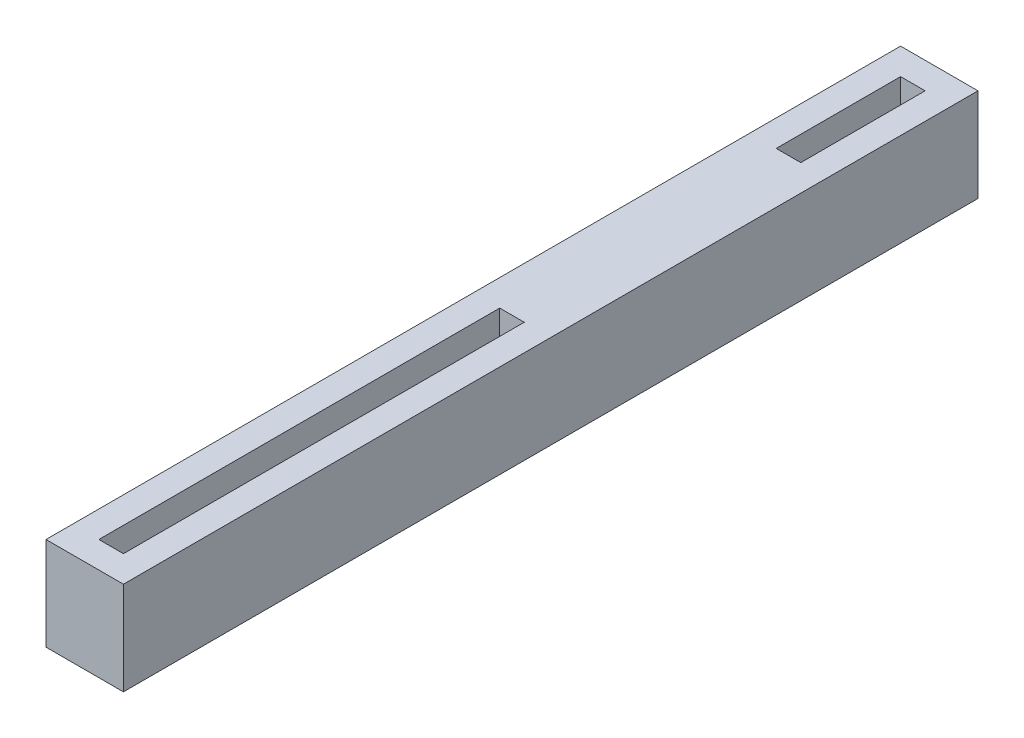
ISO-10303-21;
HEADER;
FILE_DESCRIPTION(('STEP AP214'),'2;1');
FILE_NAME('part.step','',(''),(''),'','','');
FILE_SCHEMA(('AUTOMOTIVE_DESIGN { 1 0 10303 214 1 1 1 1 }'));
ENDSEC;
DATA;
#1=APPLICATION_CONTEXT('core data for automotive mechanical design processes');
#2=APPLICATION_PROTOCOL_DEFINITION('international standard','automotive_design',2000,#1);
#3=PRODUCT_CONTEXT('',#1,'mechanical');
#4=PRODUCT('Part','Part','',(#3));
#5=PRODUCT_RELATED_PRODUCT_CATEGORY('part','',(#4));
#6=PRODUCT_DEFINITION_FORMATION('','',#4);
#7=PRODUCT_DEFINITION_CONTEXT('part definition',#1,'design');
#8=PRODUCT_DEFINITION('design','',#6,#7);
#9=PRODUCT_DEFINITION_SHAPE('','',#8);
#10=(LENGTH_UNIT() NAMED_UNIT(*) SI_UNIT(.MILLI.,.METRE.));
#11=(NAMED_UNIT(*) PLANE_ANGLE_UNIT() SI_UNIT($,.RADIAN.));
#12=(NAMED_UNIT(*) SI_UNIT($,.STERADIAN.) SOLID_ANGLE_UNIT());
#13=UNCERTAINTY_MEASURE_WITH_UNIT(LENGTH_MEASURE(1.E-05),#10,'distance_accuracy_value','');
#14=(GEOMETRIC_REPRESENTATION_CONTEXT(3) GLOBAL_UNCERTAINTY_ASSIGNED_CONTEXT((#13)) GLOBAL_UNIT_ASSIGNED_CONTEXT((#10,
#11,#12)) REPRESENTATION_CONTEXT('',''));
#15=CARTESIAN_POINT('',(0.,0.,0.));
#16=DIRECTION('',(0.,0.,1.));
#17=DIRECTION('',(1.,0.,0.));
#18=AXIS2_PLACEMENT_3D('',#15,#16,#17);
#19=CARTESIAN_POINT('',(-14.2963683314086,6.,24.442178114987));
#20=DIRECTION('',(1.,0.,0.));
#21=DIRECTION('',(0.,0.,-1.));
#22=AXIS2_PLACEMENT_3D('',#19,#20,#21);
#23=PLANE('',#22);
#24=DIRECTION('',(0.,0.,1.));
#25=VECTOR('',#24,1.);
#26=CARTESIAN_POINT('',(-14.2963683314086,0.,24.442178114987));
#27=LINE('',#26,#25);
#28=CARTESIAN_POINT('',(-14.2963683314086,0.,-30.5296639851347));
#29=VERTEX_POINT('',#28);
#30=CARTESIAN_POINT('',(-14.2963683314086,0.,24.442178114987));
#31=VERTEX_POINT('',#30);
#32=EDGE_CURVE('E194',#29,#31,#27,.T.);
#33=ORIENTED_EDGE('',*,*,#32,.T.);
#34=DIRECTION('',(0.,-1.,0.));
#35=VECTOR('',#34,1.);
#36=CARTESIAN_POINT('',(-14.2963683314086,6.,24.442178114987));
#37=LINE('',#36,#35);
#38=CARTESIAN_POINT('',(-14.2963683314086,6.,24.442178114987));
#39=VERTEX_POINT('',#38);
#40=EDGE_CURVE('E241',#39,#31,#37,.T.);
#41=ORIENTED_EDGE('',*,*,#40,.F.);
#42=DIRECTION('',(0.,0.,1.));
#43=VECTOR('',#42,1.);
#44=CARTESIAN_POINT('',(-14.2963683314086,6.,24.442178114987));
#45=LINE('',#44,#43);
#46=CARTESIAN_POINT('',(-14.2963683314086,6.,-30.5296639851347));
#47=VERTEX_POINT('',#46);
#48=EDGE_CURVE('E204',#47,#39,#45,.T.);
#49=ORIENTED_EDGE('',*,*,#48,.F.);
#50=DIRECTION('',(0.,-1.,0.));
#51=VECTOR('',#50,1.);
#52=CARTESIAN_POINT('',(-14.2963683314086,6.,-30.5296639851347));
#53=LINE('',#52,#51);
#54=EDGE_CURVE('E218',#47,#29,#53,.T.);
#55=ORIENTED_EDGE('',*,*,#54,.T.);
#56=EDGE_LOOP('',(#33,#41,#49,#55));
#57=FACE_BOUND('',#56,.T.);
#58=ADVANCED_FACE('F39',(#57),#23,.F.);
#59=CARTESIAN_POINT('',(-9.31569807401334,6.,24.442178114987));
#60=DIRECTION('',(0.,0.,-1.));
#61=DIRECTION('',(-1.,0.,0.));
#62=AXIS2_PLACEMENT_3D('',#59,#60,#61);
#63=PLANE('',#62);
#64=DIRECTION('',(1.,0.,0.));
#65=VECTOR('',#64,1.);
#66=CARTESIAN_POINT('',(-9.31569807401334,0.,24.442178114987));
#67=LINE('',#66,#65);
#68=CARTESIAN_POINT('',(-9.31569807401334,0.,24.442178114987));
#69=VERTEX_POINT('',#68);
#70=EDGE_CURVE('E222',#31,#69,#67,.T.);
#71=ORIENTED_EDGE('',*,*,#70,.T.);
#72=DIRECTION('',(0.,-1.,0.));
#73=VECTOR('',#72,1.);
#74=CARTESIAN_POINT('',(-9.31569807401334,6.,24.442178114987));
#75=LINE('',#74,#73);
#76=CARTESIAN_POINT('',(-9.31569807401334,6.,24.442178114987));
#77=VERTEX_POINT('',#76);
#78=EDGE_CURVE('E237',#77,#69,#75,.T.);
#79=ORIENTED_EDGE('',*,*,#78,.F.);
#80=DIRECTION('',(1.,0.,0.));
#81=VECTOR('',#80,1.);
#82=CARTESIAN_POINT('',(-9.31569807401334,6.,24.442178114987));
#83=LINE('',#82,#81);
#84=EDGE_CURVE('E208',#39,#77,#83,.T.);
#85=ORIENTED_EDGE('',*,*,#84,.F.);
#86=ORIENTED_EDGE('',*,*,#40,.T.);
#87=EDGE_LOOP('',(#71,#79,#85,#86));
#88=FACE_BOUND('',#87,.T.);
#89=ADVANCED_FACE('F287',(#88),#63,.F.);
#90=CARTESIAN_POINT('',(-9.31569807401392,6.,-30.5296639851347));
#91=DIRECTION('',(-1.,0.,0.));
#92=DIRECTION('',(0.,0.,1.));
#93=AXIS2_PLACEMENT_3D('',#90,#91,#92);
#94=PLANE('',#93);
#95=DIRECTION('',(0.,0.,-1.));
#96=VECTOR('',#95,1.);
#97=CARTESIAN_POINT('',(-9.31569807401392,0.,-30.5296639851347));
#98=LINE('',#97,#96);
#99=CARTESIAN_POINT('',(-9.31569807401392,0.,-30.5296639851347));
#100=VERTEX_POINT('',#99);
#101=EDGE_CURVE('E225',#69,#100,#98,.T.);
#102=ORIENTED_EDGE('',*,*,#101,.T.);
#103=DIRECTION('',(0.,-1.,0.));
#104=VECTOR('',#103,1.);
#105=CARTESIAN_POINT('',(-9.31569807401392,6.,-30.5296639851347));
#106=LINE('',#105,#104);
#107=CARTESIAN_POINT('',(-9.31569807401392,6.,-30.5296639851347));
#108=VERTEX_POINT('',#107);
#109=EDGE_CURVE('E233',#108,#100,#106,.T.);
#110=ORIENTED_EDGE('',*,*,#109,.F.);
#111=DIRECTION('',(0.,0.,-1.));
#112=VECTOR('',#111,1.);
#113=CARTESIAN_POINT('',(-9.31569807401392,6.,-30.5296639851347));
#114=LINE('',#113,#112);
#115=EDGE_CURVE('E212',#77,#108,#114,.T.);
#116=ORIENTED_EDGE('',*,*,#115,.F.);
#117=ORIENTED_EDGE('',*,*,#78,.T.);
#118=EDGE_LOOP('',(#102,#110,#116,#117));
#119=FACE_BOUND('',#118,.T.);
#120=ADVANCED_FACE('F292',(#119),#94,.F.);
#121=CARTESIAN_POINT('',(-14.2963683314086,6.,-30.5296639851347));
#122=DIRECTION('',(0.,0.,1.));
#123=DIRECTION('',(1.,0.,0.));
#124=AXIS2_PLACEMENT_3D('',#121,#122,#123);
#125=PLANE('',#124);
#126=DIRECTION('',(-1.,0.,0.));
#127=VECTOR('',#126,1.);
#128=CARTESIAN_POINT('',(-14.2963683314086,0.,-30.5296639851347));
#129=LINE('',#128,#127);
#130=EDGE_CURVE('E209',#100,#29,#129,.T.);
#131=ORIENTED_EDGE('',*,*,#130,.T.);
#132=ORIENTED_EDGE('',*,*,#54,.F.);
#133=DIRECTION('',(-1.,0.,0.));
#134=VECTOR('',#133,1.);
#135=CARTESIAN_POINT('',(-14.2963683314086,6.,-30.5296639851347));
#136=LINE('',#135,#134);
#137=EDGE_CURVE('E215',#108,#47,#136,.T.);
#138=ORIENTED_EDGE('',*,*,#137,.F.);
#139=ORIENTED_EDGE('',*,*,#109,.T.);
#140=EDGE_LOOP('',(#131,#132,#138,#139));
#141=FACE_BOUND('',#140,.T.);
#142=ADVANCED_FACE('F276',(#141),#125,.F.);
#143=CARTESIAN_POINT('',(0.,6.,0.));
#144=DIRECTION('',(0.,-1.,0.));
#145=DIRECTION('',(0.,0.,-1.));
#146=AXIS2_PLACEMENT_3D('',#143,#144,#145);
#147=PLANE('',#146);
#148=DIRECTION('',(1.,0.,0.));
#149=VECTOR('',#148,1.);
#150=CARTESIAN_POINT('',(0.,6.,-3.04374293507385));
#151=LINE('',#150,#149);
#152=CARTESIAN_POINT('',(-12.5963683314086,6.,-3.04374293507385));
#153=VERTEX_POINT('',#152);
#154=CARTESIAN_POINT('',(-11.0156980740136,6.,-3.04374293507385));
#155=VERTEX_POINT('',#154);
#156=EDGE_CURVE('E167',#153,#155,#151,.T.);
#157=ORIENTED_EDGE('',*,*,#156,.T.);
#158=DIRECTION('',(0.,0.,1.));
#159=VECTOR('',#158,1.);
#160=CARTESIAN_POINT('',(-11.0156980740136,6.,1.14865955437683E-13));
#161=LINE('',#160,#159);
#162=CARTESIAN_POINT('',(-11.0156980740134,6.,22.742178114987));
#163=VERTEX_POINT('',#162);
#164=EDGE_CURVE('E171',#155,#163,#161,.T.);
#165=ORIENTED_EDGE('',*,*,#164,.T.);
#166=DIRECTION('',(-1.,0.,0.));
#167=VECTOR('',#166,1.);
#168=CARTESIAN_POINT('',(0.,6.,22.742178114987));
#169=LINE('',#168,#167);
#170=CARTESIAN_POINT('',(-12.5963683314086,6.,22.742178114987));
#171=VERTEX_POINT('',#170);
#172=EDGE_CURVE('E158',#163,#171,#169,.T.);
#173=ORIENTED_EDGE('',*,*,#172,.T.);
#174=DIRECTION('',(0.,0.,-1.));
#175=VECTOR('',#174,1.);
#176=CARTESIAN_POINT('',(-12.5963683314086,6.,0.));
#177=LINE('',#176,#175);
#178=EDGE_CURVE('E133',#171,#153,#177,.T.);
#179=ORIENTED_EDGE('',*,*,#178,.T.);
#180=EDGE_LOOP('',(#157,#165,#173,#179));
#181=FACE_BOUND('',#180,.T.);
#182=DIRECTION('',(1.,0.,0.));
#183=VECTOR('',#182,1.);
#184=CARTESIAN_POINT('',(-12.5963683314086,6.,-20.8296639851347));
#185=LINE('',#184,#183);
#186=CARTESIAN_POINT('',(-12.5963683314086,6.,-20.8296639851347));
#187=VERTEX_POINT('',#186);
#188=CARTESIAN_POINT('',(-11.0156980740138,6.,-20.8296639851347));
#189=VERTEX_POINT('',#188);
#190=EDGE_CURVE('E178',#187,#189,#185,.T.);
#191=ORIENTED_EDGE('',*,*,#190,.F.);
#192=DIRECTION('',(0.,0.,1.));
#193=VECTOR('',#192,1.);
#194=CARTESIAN_POINT('',(-12.5963683314086,6.,-28.8296639851347));
#195=LINE('',#194,#193);
#196=CARTESIAN_POINT('',(-12.5963683314086,6.,-28.8296639851347));
#197=VERTEX_POINT('',#196);
#198=EDGE_CURVE('E175',#197,#187,#195,.T.);
#199=ORIENTED_EDGE('',*,*,#198,.F.);
#200=DIRECTION('',(-1.,0.,0.));
#201=VECTOR('',#200,1.);
#202=CARTESIAN_POINT('',(-11.0156980740139,6.,-28.8296639851347));
#203=LINE('',#202,#201);
#204=CARTESIAN_POINT('',(-11.0156980740139,6.,-28.8296639851347));
#205=VERTEX_POINT('',#204);
#206=EDGE_CURVE('E186',#205,#197,#203,.T.);
#207=ORIENTED_EDGE('',*,*,#206,.F.);
#208=DIRECTION('',(0.,0.,-1.));
#209=VECTOR('',#208,1.);
#210=CARTESIAN_POINT('',(-11.0156980740138,6.,-20.8296639851347));
#211=LINE('',#210,#209);
#212=EDGE_CURVE('E182',#189,#205,#211,.T.);
#213=ORIENTED_EDGE('',*,*,#212,.F.);
#214=EDGE_LOOP('',(#191,#199,#207,#213));
#215=FACE_BOUND('',#214,.T.);
#216=ORIENTED_EDGE('',*,*,#48,.T.);
#217=ORIENTED_EDGE('',*,*,#84,.T.);
#218=ORIENTED_EDGE('',*,*,#115,.T.);
#219=ORIENTED_EDGE('',*,*,#137,.T.);
#220=EDGE_LOOP('',(#216,#217,#218,#219));
#221=FACE_BOUND('',#220,.T.);
#222=ADVANCED_FACE('F273',(#181,#215,#221),#147,.F.);
#223=CARTESIAN_POINT('',(0.,0.,0.));
#224=DIRECTION('',(0.,-1.,0.));
#225=DIRECTION('',(0.,0.,-1.));
#226=AXIS2_PLACEMENT_3D('',#223,#224,#225);
#227=PLANE('',#226);
#228=DIRECTION('',(0.,0.,1.));
#229=VECTOR('',#228,1.);
#230=CARTESIAN_POINT('',(-11.0156980740136,0.,-3.04374293507385));
#231=LINE('',#230,#229);
#232=CARTESIAN_POINT('',(-11.0156980740136,0.,-3.04374293507385));
#233=VERTEX_POINT('',#232);
#234=CARTESIAN_POINT('',(-11.0156980740134,0.,22.742178114987));
#235=VERTEX_POINT('',#234);
#236=EDGE_CURVE('E62',#233,#235,#231,.T.);
#237=ORIENTED_EDGE('',*,*,#236,.F.);
#238=DIRECTION('',(1.,0.,0.));
#239=VECTOR('',#238,1.);
#240=CARTESIAN_POINT('',(-11.0156980740136,0.,-3.04374293507385));
#241=LINE('',#240,#239);
#242=CARTESIAN_POINT('',(-12.5963683314086,0.,-3.04374293507385));
#243=VERTEX_POINT('',#242);
#244=EDGE_CURVE('E148',#243,#233,#241,.T.);
#245=ORIENTED_EDGE('',*,*,#244,.F.);
#246=DIRECTION('',(0.,0.,-1.));
#247=VECTOR('',#246,1.);
#248=CARTESIAN_POINT('',(-12.5963683314086,0.,22.742178114987));
#249=LINE('',#248,#247);
#250=CARTESIAN_POINT('',(-12.5963683314086,0.,22.742178114987));
#251=VERTEX_POINT('',#250);
#252=EDGE_CURVE('E130',#251,#243,#249,.T.);
#253=ORIENTED_EDGE('',*,*,#252,.F.);
#254=DIRECTION('',(-1.,0.,0.));
#255=VECTOR('',#254,1.);
#256=CARTESIAN_POINT('',(-11.0156980740134,0.,22.742178114987));
#257=LINE('',#256,#255);
#258=EDGE_CURVE('E140',#235,#251,#257,.T.);
#259=ORIENTED_EDGE('',*,*,#258,.F.);
#260=EDGE_LOOP('',(#237,#245,#253,#259));
#261=FACE_BOUND('',#260,.T.);
#262=DIRECTION('',(0.,0.,-1.));
#263=VECTOR('',#262,1.);
#264=CARTESIAN_POINT('',(-12.5963683314086,0.,0.));
#265=LINE('',#264,#263);
#266=CARTESIAN_POINT('',(-12.5963683314086,0.,-20.8296639851347));
#267=VERTEX_POINT('',#266);
#268=CARTESIAN_POINT('',(-12.5963683314086,0.,-28.8296639851347));
#269=VERTEX_POINT('',#268);
#270=EDGE_CURVE('E11',#267,#269,#265,.T.);
#271=ORIENTED_EDGE('',*,*,#270,.F.);
#272=DIRECTION('',(-1.,0.,0.));
#273=VECTOR('',#272,1.);
#274=CARTESIAN_POINT('',(0.,0.,-20.8296639851347));
#275=LINE('',#274,#273);
#276=CARTESIAN_POINT('',(-11.0156980740138,0.,-20.8296639851347));
#277=VERTEX_POINT('',#276);
#278=EDGE_CURVE('E245',#277,#267,#275,.T.);
#279=ORIENTED_EDGE('',*,*,#278,.F.);
#280=DIRECTION('',(0.,0.,1.));
#281=VECTOR('',#280,1.);
#282=CARTESIAN_POINT('',(-11.0156980740136,0.,1.14655140319583E-13));
#283=LINE('',#282,#281);
#284=CARTESIAN_POINT('',(-11.0156980740139,0.,-28.8296639851347));
#285=VERTEX_POINT('',#284);
#286=EDGE_CURVE('E248',#285,#277,#283,.T.);
#287=ORIENTED_EDGE('',*,*,#286,.F.);
#288=DIRECTION('',(1.,0.,0.));
#289=VECTOR('',#288,1.);
#290=CARTESIAN_POINT('',(0.,0.,-28.8296639851347));
#291=LINE('',#290,#289);
#292=EDGE_CURVE('E47',#269,#285,#291,.T.);
#293=ORIENTED_EDGE('',*,*,#292,.F.);
#294=EDGE_LOOP('',(#271,#279,#287,#293));
#295=FACE_BOUND('',#294,.T.);
#296=ORIENTED_EDGE('',*,*,#32,.F.);
#297=ORIENTED_EDGE('',*,*,#130,.F.);
#298=ORIENTED_EDGE('',*,*,#101,.F.);
#299=ORIENTED_EDGE('',*,*,#70,.F.);
#300=EDGE_LOOP('',(#296,#297,#298,#299));
#301=FACE_BOUND('',#300,.T.);
#302=ADVANCED_FACE('F145',(#261,#295,#301),#227,.T.);
#303=CARTESIAN_POINT('',(-12.5963683314086,-0.999999999999999,-28.8296639851347));
#304=DIRECTION('',(-1.,0.,0.));
#305=DIRECTION('',(0.,0.,1.));
#306=AXIS2_PLACEMENT_3D('',#303,#304,#305);
#307=PLANE('',#306);
#308=ORIENTED_EDGE('',*,*,#270,.T.);
#309=DIRECTION('',(0.,1.,0.));
#310=VECTOR('',#309,1.);
#311=CARTESIAN_POINT('',(-12.5963683314086,-0.999999999999999,-28.8296639851347));
#312=LINE('',#311,#310);
#313=EDGE_CURVE('E191',#269,#197,#312,.T.);
#314=ORIENTED_EDGE('',*,*,#313,.T.);
#315=ORIENTED_EDGE('',*,*,#198,.T.);
#316=DIRECTION('',(0.,1.,0.));
#317=VECTOR('',#316,1.);
#318=CARTESIAN_POINT('',(-12.5963683314086,-0.999999999999999,-20.8296639851347));
#319=LINE('',#318,#317);
#320=EDGE_CURVE('E190',#267,#187,#319,.T.);
#321=ORIENTED_EDGE('',*,*,#320,.F.);
#322=EDGE_LOOP('',(#308,#314,#315,#321));
#323=FACE_BOUND('',#322,.T.);
#324=ADVANCED_FACE('F270',(#323),#307,.F.);
#325=CARTESIAN_POINT('',(-11.0156980740139,-0.999999999999999,-28.8296639851347));
#326=DIRECTION('',(0.,0.,-1.));
#327=DIRECTION('',(-1.,0.,0.));
#328=AXIS2_PLACEMENT_3D('',#325,#326,#327);
#329=PLANE('',#328);
#330=ORIENTED_EDGE('',*,*,#292,.T.);
#331=DIRECTION('',(0.,1.,0.));
#332=VECTOR('',#331,1.);
#333=CARTESIAN_POINT('',(-11.0156980740139,-0.999999999999999,-28.8296639851347));
#334=LINE('',#333,#332);
#335=EDGE_CURVE('E195',#285,#205,#334,.T.);
#336=ORIENTED_EDGE('',*,*,#335,.T.);
#337=ORIENTED_EDGE('',*,*,#206,.T.);
#338=ORIENTED_EDGE('',*,*,#313,.F.);
#339=EDGE_LOOP('',(#330,#336,#337,#338));
#340=FACE_BOUND('',#339,.T.);
#341=ADVANCED_FACE('F256',(#340),#329,.F.);
#342=CARTESIAN_POINT('',(-11.0156980740138,-0.999999999999999,-20.8296639851347));
#343=DIRECTION('',(1.,0.,0.));
#344=DIRECTION('',(0.,0.,-1.));
#345=AXIS2_PLACEMENT_3D('',#342,#343,#344);
#346=PLANE('',#345);
#347=ORIENTED_EDGE('',*,*,#286,.T.);
#348=DIRECTION('',(0.,1.,0.));
#349=VECTOR('',#348,1.);
#350=CARTESIAN_POINT('',(-11.0156980740138,-0.999999999999999,-20.8296639851347));
#351=LINE('',#350,#349);
#352=EDGE_CURVE('E198',#277,#189,#351,.T.);
#353=ORIENTED_EDGE('',*,*,#352,.T.);
#354=ORIENTED_EDGE('',*,*,#212,.T.);
#355=ORIENTED_EDGE('',*,*,#335,.F.);
#356=EDGE_LOOP('',(#347,#353,#354,#355));
#357=FACE_BOUND('',#356,.T.);
#358=ADVANCED_FACE('F260',(#357),#346,.F.);
#359=CARTESIAN_POINT('',(-12.5963683314086,-0.999999999999999,-20.8296639851347));
#360=DIRECTION('',(0.,0.,1.));
#361=DIRECTION('',(1.,0.,0.));
#362=AXIS2_PLACEMENT_3D('',#359,#360,#361);
#363=PLANE('',#362);
#364=ORIENTED_EDGE('',*,*,#278,.T.);
#365=ORIENTED_EDGE('',*,*,#320,.T.);
#366=ORIENTED_EDGE('',*,*,#190,.T.);
#367=ORIENTED_EDGE('',*,*,#352,.F.);
#368=EDGE_LOOP('',(#364,#365,#366,#367));
#369=FACE_BOUND('',#368,.T.);
#370=ADVANCED_FACE('F267',(#369),#363,.F.);
#371=CARTESIAN_POINT('',(-11.0156980740136,7.,-3.04374293507385));
#372=DIRECTION('',(1.,0.,0.));
#373=DIRECTION('',(0.,0.,-1.));
#374=AXIS2_PLACEMENT_3D('',#371,#372,#373);
#375=PLANE('',#374);
#376=DIRECTION('',(0.,-1.,0.));
#377=VECTOR('',#376,1.);
#378=CARTESIAN_POINT('',(-11.0156980740136,7.,-3.04374293507385));
#379=LINE('',#378,#377);
#380=EDGE_CURVE('E155',#155,#233,#379,.T.);
#381=ORIENTED_EDGE('',*,*,#380,.T.);
#382=ORIENTED_EDGE('',*,*,#236,.T.);
#383=DIRECTION('',(0.,-1.,0.));
#384=VECTOR('',#383,1.);
#385=CARTESIAN_POINT('',(-11.0156980740134,7.,22.742178114987));
#386=LINE('',#385,#384);
#387=EDGE_CURVE('E137',#163,#235,#386,.T.);
#388=ORIENTED_EDGE('',*,*,#387,.F.);
#389=ORIENTED_EDGE('',*,*,#164,.F.);
#390=EDGE_LOOP('',(#381,#382,#388,#389));
#391=FACE_BOUND('',#390,.T.);
#392=ADVANCED_FACE('F335',(#391),#375,.F.);
#393=CARTESIAN_POINT('',(-11.0156980740136,7.,-3.04374293507385));
#394=DIRECTION('',(0.,0.,-1.));
#395=DIRECTION('',(-1.,0.,0.));
#396=AXIS2_PLACEMENT_3D('',#393,#394,#395);
#397=PLANE('',#396);
#398=DIRECTION('',(0.,-1.,0.));
#399=VECTOR('',#398,1.);
#400=CARTESIAN_POINT('',(-12.5963683314086,7.,-3.04374293507385));
#401=LINE('',#400,#399);
#402=EDGE_CURVE('E136',#153,#243,#401,.T.);
#403=ORIENTED_EDGE('',*,*,#402,.T.);
#404=ORIENTED_EDGE('',*,*,#244,.T.);
#405=ORIENTED_EDGE('',*,*,#380,.F.);
#406=ORIENTED_EDGE('',*,*,#156,.F.);
#407=EDGE_LOOP('',(#403,#404,#405,#406));
#408=FACE_BOUND('',#407,.T.);
#409=ADVANCED_FACE('F340',(#408),#397,.F.);
#410=CARTESIAN_POINT('',(-12.5963683314086,7.,22.742178114987));
#411=DIRECTION('',(-1.,0.,0.));
#412=DIRECTION('',(0.,0.,1.));
#413=AXIS2_PLACEMENT_3D('',#410,#411,#412);
#414=PLANE('',#413);
#415=DIRECTION('',(0.,-1.,0.));
#416=VECTOR('',#415,1.);
#417=CARTESIAN_POINT('',(-12.5963683314086,7.,22.742178114987));
#418=LINE('',#417,#416);
#419=EDGE_CURVE('E54',#171,#251,#418,.T.);
#420=ORIENTED_EDGE('',*,*,#419,.T.);
#421=ORIENTED_EDGE('',*,*,#252,.T.);
#422=ORIENTED_EDGE('',*,*,#402,.F.);
#423=ORIENTED_EDGE('',*,*,#178,.F.);
#424=EDGE_LOOP('',(#420,#421,#422,#423));
#425=FACE_BOUND('',#424,.T.);
#426=ADVANCED_FACE('F127',(#425),#414,.F.);
#427=CARTESIAN_POINT('',(-11.0156980740134,7.,22.742178114987));
#428=DIRECTION('',(0.,0.,1.));
#429=DIRECTION('',(1.,0.,0.));
#430=AXIS2_PLACEMENT_3D('',#427,#428,#429);
#431=PLANE('',#430);
#432=ORIENTED_EDGE('',*,*,#387,.T.);
#433=ORIENTED_EDGE('',*,*,#258,.T.);
#434=ORIENTED_EDGE('',*,*,#419,.F.);
#435=ORIENTED_EDGE('',*,*,#172,.F.);
#436=EDGE_LOOP('',(#432,#433,#434,#435));
#437=FACE_BOUND('',#436,.T.);
#438=ADVANCED_FACE('F141',(#437),#431,.F.);
#439=CLOSED_SHELL('',(#58,#89,#120,#142,#222,#302,#324,#341,#358,#370,#392,#409,#426,#438));
#440=MANIFOLD_SOLID_BREP('B2',#439);
#441=ADVANCED_BREP_SHAPE_REPRESENTATION('',(#18,#440),#14);
#442=SHAPE_DEFINITION_REPRESENTATION(#9,#441);
ENDSEC;
END-ISO-10303-21;
